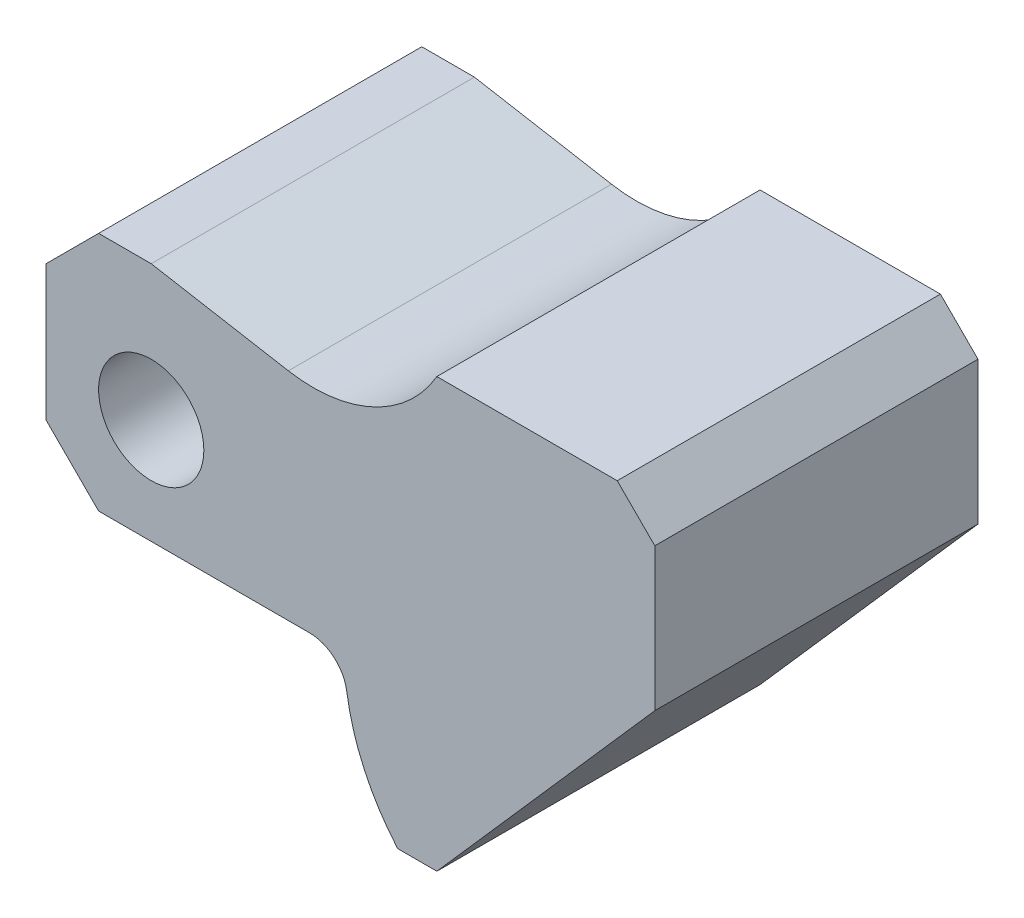
ISO-10303-21;
HEADER;
FILE_DESCRIPTION(('STEP AP214'),'2;1');
FILE_NAME('part.step','',(''),(''),'','','');
FILE_SCHEMA(('AUTOMOTIVE_DESIGN { 1 0 10303 214 1 1 1 1 }'));
ENDSEC;
DATA;
#1=APPLICATION_CONTEXT('core data for automotive mechanical design processes');
#2=APPLICATION_PROTOCOL_DEFINITION('international standard','automotive_design',2000,#1);
#3=PRODUCT_CONTEXT('',#1,'mechanical');
#4=PRODUCT('Part','Part','',(#3));
#5=PRODUCT_RELATED_PRODUCT_CATEGORY('part','',(#4));
#6=PRODUCT_DEFINITION_FORMATION('','',#4);
#7=PRODUCT_DEFINITION_CONTEXT('part definition',#1,'design');
#8=PRODUCT_DEFINITION('design','',#6,#7);
#9=PRODUCT_DEFINITION_SHAPE('','',#8);
#10=(LENGTH_UNIT() NAMED_UNIT(*) SI_UNIT(.MILLI.,.METRE.));
#11=(NAMED_UNIT(*) PLANE_ANGLE_UNIT() SI_UNIT($,.RADIAN.));
#12=(NAMED_UNIT(*) SI_UNIT($,.STERADIAN.) SOLID_ANGLE_UNIT());
#13=UNCERTAINTY_MEASURE_WITH_UNIT(LENGTH_MEASURE(1.E-05),#10,'distance_accuracy_value','');
#14=(GEOMETRIC_REPRESENTATION_CONTEXT(3) GLOBAL_UNCERTAINTY_ASSIGNED_CONTEXT((#13)) GLOBAL_UNIT_ASSIGNED_CONTEXT((#10,
#11,#12)) REPRESENTATION_CONTEXT('',''));
#15=CARTESIAN_POINT('',(0.,0.,0.));
#16=DIRECTION('',(0.,0.,1.));
#17=DIRECTION('',(1.,0.,0.));
#18=AXIS2_PLACEMENT_3D('',#15,#16,#17);
#19=CARTESIAN_POINT('',(54.6337851198582,-48.006231786545,43.));
#20=DIRECTION('',(0.751200870855045,-0.660073671362994,0.));
#21=DIRECTION('',(0.660073671362994,0.751200870855045,0.));
#22=AXIS2_PLACEMENT_3D('',#19,#20,#21);
#23=PLANE('',#22);
#24=DIRECTION('',(-0.660073671362994,-0.751200870855045,0.));
#25=VECTOR('',#24,1.);
#26=CARTESIAN_POINT('',(54.6337851198582,-48.006231786545,0.));
#27=LINE('',#26,#25);
#28=CARTESIAN_POINT('',(81.,-18.,0.));
#29=VERTEX_POINT('',#28);
#30=CARTESIAN_POINT('',(52.0031870301412,-51.,0.));
#31=VERTEX_POINT('',#30);
#32=EDGE_CURVE('E175',#29,#31,#27,.T.);
#33=ORIENTED_EDGE('',*,*,#32,.F.);
#34=DIRECTION('',(0.,0.,-1.));
#35=VECTOR('',#34,1.);
#36=CARTESIAN_POINT('',(81.,-18.,43.));
#37=LINE('',#36,#35);
#38=CARTESIAN_POINT('',(81.,-18.,43.));
#39=VERTEX_POINT('',#38);
#40=EDGE_CURVE('E161',#39,#29,#37,.T.);
#41=ORIENTED_EDGE('',*,*,#40,.F.);
#42=DIRECTION('',(-0.660073671362994,-0.751200870855045,0.));
#43=VECTOR('',#42,1.);
#44=CARTESIAN_POINT('',(54.6337851198582,-48.006231786545,43.));
#45=LINE('',#44,#43);
#46=CARTESIAN_POINT('',(52.0031870301412,-51.,43.));
#47=VERTEX_POINT('',#46);
#48=EDGE_CURVE('E170',#39,#47,#45,.T.);
#49=ORIENTED_EDGE('',*,*,#48,.T.);
#50=DIRECTION('',(0.,0.,-1.));
#51=VECTOR('',#50,1.);
#52=CARTESIAN_POINT('',(52.0031870301412,-51.,43.));
#53=LINE('',#52,#51);
#54=EDGE_CURVE('E218',#47,#31,#53,.T.);
#55=ORIENTED_EDGE('',*,*,#54,.T.);
#56=EDGE_LOOP('',(#33,#41,#49,#55));
#57=FACE_BOUND('',#56,.T.);
#58=ADVANCED_FACE('F55',(#57),#23,.T.);
#59=CARTESIAN_POINT('',(81.,0.,43.));
#60=DIRECTION('',(1.,0.,0.));
#61=DIRECTION('',(0.,1.,0.));
#62=AXIS2_PLACEMENT_3D('',#59,#60,#61);
#63=PLANE('',#62);
#64=DIRECTION('',(0.,-1.,0.));
#65=VECTOR('',#64,1.);
#66=CARTESIAN_POINT('',(81.,0.,0.));
#67=LINE('',#66,#65);
#68=CARTESIAN_POINT('',(81.,0.999999999999964,0.));
#69=VERTEX_POINT('',#68);
#70=EDGE_CURVE('E225',#69,#29,#67,.T.);
#71=ORIENTED_EDGE('',*,*,#70,.F.);
#72=DIRECTION('',(0.,0.,1.));
#73=VECTOR('',#72,1.);
#74=CARTESIAN_POINT('',(81.,0.999999999999964,43.));
#75=LINE('',#74,#73);
#76=CARTESIAN_POINT('',(81.,0.999999999999964,43.));
#77=VERTEX_POINT('',#76);
#78=EDGE_CURVE('E164',#69,#77,#75,.T.);
#79=ORIENTED_EDGE('',*,*,#78,.T.);
#80=DIRECTION('',(0.,-1.,0.));
#81=VECTOR('',#80,1.);
#82=CARTESIAN_POINT('',(81.,0.,43.));
#83=LINE('',#82,#81);
#84=EDGE_CURVE('E157',#77,#39,#83,.T.);
#85=ORIENTED_EDGE('',*,*,#84,.T.);
#86=ORIENTED_EDGE('',*,*,#40,.T.);
#87=EDGE_LOOP('',(#71,#79,#85,#86));
#88=FACE_BOUND('',#87,.T.);
#89=ADVANCED_FACE('F160',(#88),#63,.T.);
#90=CARTESIAN_POINT('',(0.,6.,43.));
#91=DIRECTION('',(0.,1.,0.));
#92=DIRECTION('',(-1.,0.,0.));
#93=AXIS2_PLACEMENT_3D('',#90,#91,#92);
#94=PLANE('',#93);
#95=DIRECTION('',(1.,0.,0.));
#96=VECTOR('',#95,1.);
#97=CARTESIAN_POINT('',(0.,6.,43.));
#98=LINE('',#97,#96);
#99=CARTESIAN_POINT('',(52.,6.,43.));
#100=VERTEX_POINT('',#99);
#101=CARTESIAN_POINT('',(76.,6.,43.));
#102=VERTEX_POINT('',#101);
#103=EDGE_CURVE('E169',#100,#102,#98,.T.);
#104=ORIENTED_EDGE('',*,*,#103,.T.);
#105=DIRECTION('',(0.,0.,-1.));
#106=VECTOR('',#105,1.);
#107=CARTESIAN_POINT('',(76.,6.,43.));
#108=LINE('',#107,#106);
#109=CARTESIAN_POINT('',(76.,6.,0.));
#110=VERTEX_POINT('',#109);
#111=EDGE_CURVE('E296',#102,#110,#108,.T.);
#112=ORIENTED_EDGE('',*,*,#111,.T.);
#113=DIRECTION('',(1.,0.,0.));
#114=VECTOR('',#113,1.);
#115=CARTESIAN_POINT('',(0.,6.,0.));
#116=LINE('',#115,#114);
#117=CARTESIAN_POINT('',(52.,6.,0.));
#118=VERTEX_POINT('',#117);
#119=EDGE_CURVE('E228',#118,#110,#116,.T.);
#120=ORIENTED_EDGE('',*,*,#119,.F.);
#121=DIRECTION('',(0.,0.,-1.));
#122=VECTOR('',#121,1.);
#123=CARTESIAN_POINT('',(52.,6.,43.));
#124=LINE('',#123,#122);
#125=EDGE_CURVE('E178',#100,#118,#124,.T.);
#126=ORIENTED_EDGE('',*,*,#125,.F.);
#127=EDGE_LOOP('',(#104,#112,#120,#126));
#128=FACE_BOUND('',#127,.T.);
#129=ADVANCED_FACE('F343',(#128),#94,.T.);
#130=CARTESIAN_POINT('',(35.5424003635473,15.4945992125119,43.));
#131=DIRECTION('',(0.,0.,-1.));
#132=DIRECTION('',(-1.,0.,0.));
#133=AXIS2_PLACEMENT_3D('',#130,#131,#132);
#134=CYLINDRICAL_SURFACE('',#133,19.);
#135=CARTESIAN_POINT('',(35.5424003635473,15.4945992125119,0.));
#136=DIRECTION('',(0.,0.,1.));
#137=DIRECTION('',(1.,0.,0.));
#138=AXIS2_PLACEMENT_3D('',#135,#136,#137);
#139=CIRCLE('',#138,19.);
#140=CARTESIAN_POINT('',(32.2430849878756,-3.21674809472005,0.));
#141=VERTEX_POINT('',#140);
#142=EDGE_CURVE('E232',#141,#118,#139,.T.);
#143=ORIENTED_EDGE('',*,*,#142,.F.);
#144=DIRECTION('',(0.,0.,-1.));
#145=VECTOR('',#144,1.);
#146=CARTESIAN_POINT('',(32.2430849878756,-3.21674809472005,43.));
#147=LINE('',#146,#145);
#148=CARTESIAN_POINT('',(32.2430849878756,-3.21674809472005,43.));
#149=VERTEX_POINT('',#148);
#150=EDGE_CURVE('E266',#149,#141,#147,.T.);
#151=ORIENTED_EDGE('',*,*,#150,.F.);
#152=CARTESIAN_POINT('',(35.5424003635473,15.4945992125119,43.));
#153=DIRECTION('',(0.,0.,1.));
#154=DIRECTION('',(1.,0.,0.));
#155=AXIS2_PLACEMENT_3D('',#152,#153,#154);
#156=CIRCLE('',#155,19.);
#157=EDGE_CURVE('E195',#149,#100,#156,.T.);
#158=ORIENTED_EDGE('',*,*,#157,.T.);
#159=ORIENTED_EDGE('',*,*,#125,.T.);
#160=EDGE_LOOP('',(#143,#151,#158,#159));
#161=FACE_BOUND('',#160,.T.);
#162=ADVANCED_FACE('F376',(#161),#134,.F.);
#163=CARTESIAN_POINT('',(0.422151654498645,2.39414100327969,43.));
#164=DIRECTION('',(0.173648177666931,0.984807753012208,0.));
#165=DIRECTION('',(-0.984807753012208,0.173648177666931,0.));
#166=AXIS2_PLACEMENT_3D('',#163,#164,#165);
#167=PLANE('',#166);
#168=DIRECTION('',(0.984807753012208,-0.173648177666931,0.));
#169=VECTOR('',#168,1.);
#170=CARTESIAN_POINT('',(0.422151654498645,2.39414100327969,0.));
#171=LINE('',#170,#169);
#172=CARTESIAN_POINT('',(14.,0.,0.));
#173=VERTEX_POINT('',#172);
#174=EDGE_CURVE('E236',#173,#141,#171,.T.);
#175=ORIENTED_EDGE('',*,*,#174,.F.);
#176=DIRECTION('',(0.,0.,-1.));
#177=VECTOR('',#176,1.);
#178=CARTESIAN_POINT('',(14.,0.,43.));
#179=LINE('',#178,#177);
#180=CARTESIAN_POINT('',(14.,0.,43.));
#181=VERTEX_POINT('',#180);
#182=EDGE_CURVE('E262',#181,#173,#179,.T.);
#183=ORIENTED_EDGE('',*,*,#182,.F.);
#184=DIRECTION('',(0.984807753012208,-0.173648177666931,0.));
#185=VECTOR('',#184,1.);
#186=CARTESIAN_POINT('',(0.422151654498645,2.39414100327969,43.));
#187=LINE('',#186,#185);
#188=EDGE_CURVE('E199',#181,#149,#187,.T.);
#189=ORIENTED_EDGE('',*,*,#188,.T.);
#190=ORIENTED_EDGE('',*,*,#150,.T.);
#191=EDGE_LOOP('',(#175,#183,#189,#190));
#192=FACE_BOUND('',#191,.T.);
#193=ADVANCED_FACE('F382',(#192),#167,.T.);
#194=CARTESIAN_POINT('',(0.,0.,43.));
#195=DIRECTION('',(0.,1.,0.));
#196=DIRECTION('',(0.,0.,1.));
#197=AXIS2_PLACEMENT_3D('',#194,#195,#196);
#198=PLANE('',#197);
#199=DIRECTION('',(1.,0.,0.));
#200=VECTOR('',#199,1.);
#201=CARTESIAN_POINT('',(0.,0.,0.));
#202=LINE('',#201,#200);
#203=CARTESIAN_POINT('',(7.00000000000003,0.,0.));
#204=VERTEX_POINT('',#203);
#205=EDGE_CURVE('E240',#204,#173,#202,.T.);
#206=ORIENTED_EDGE('',*,*,#205,.F.);
#207=DIRECTION('',(0.,0.,1.));
#208=VECTOR('',#207,1.);
#209=CARTESIAN_POINT('',(7.00000000000003,0.,43.));
#210=LINE('',#209,#208);
#211=CARTESIAN_POINT('',(7.00000000000003,0.,43.));
#212=VERTEX_POINT('',#211);
#213=EDGE_CURVE('E277',#204,#212,#210,.T.);
#214=ORIENTED_EDGE('',*,*,#213,.T.);
#215=DIRECTION('',(1.,0.,0.));
#216=VECTOR('',#215,1.);
#217=CARTESIAN_POINT('',(0.,0.,43.));
#218=LINE('',#217,#216);
#219=EDGE_CURVE('E203',#212,#181,#218,.T.);
#220=ORIENTED_EDGE('',*,*,#219,.T.);
#221=ORIENTED_EDGE('',*,*,#182,.T.);
#222=EDGE_LOOP('',(#206,#214,#220,#221));
#223=FACE_BOUND('',#222,.T.);
#224=ADVANCED_FACE('F385',(#223),#198,.T.);
#225=CARTESIAN_POINT('',(0.,0.,43.));
#226=DIRECTION('',(1.,0.,0.));
#227=DIRECTION('',(0.,0.,-1.));
#228=AXIS2_PLACEMENT_3D('',#225,#226,#227);
#229=PLANE('',#228);
#230=DIRECTION('',(0.,-1.,0.));
#231=VECTOR('',#230,1.);
#232=CARTESIAN_POINT('',(0.,0.,0.));
#233=LINE('',#232,#231);
#234=CARTESIAN_POINT('',(0.,-7.00000000000001,0.));
#235=VERTEX_POINT('',#234);
#236=CARTESIAN_POINT('',(0.,-25.,0.));
#237=VERTEX_POINT('',#236);
#238=EDGE_CURVE('E243',#235,#237,#233,.T.);
#239=ORIENTED_EDGE('',*,*,#238,.T.);
#240=DIRECTION('',(0.,0.,1.));
#241=VECTOR('',#240,1.);
#242=CARTESIAN_POINT('',(0.,-25.,43.));
#243=LINE('',#242,#241);
#244=CARTESIAN_POINT('',(0.,-25.,43.));
#245=VERTEX_POINT('',#244);
#246=EDGE_CURVE('E290',#237,#245,#243,.T.);
#247=ORIENTED_EDGE('',*,*,#246,.T.);
#248=DIRECTION('',(0.,-1.,0.));
#249=VECTOR('',#248,1.);
#250=CARTESIAN_POINT('',(0.,0.,43.));
#251=LINE('',#250,#249);
#252=CARTESIAN_POINT('',(0.,-7.00000000000001,43.));
#253=VERTEX_POINT('',#252);
#254=EDGE_CURVE('E206',#253,#245,#251,.T.);
#255=ORIENTED_EDGE('',*,*,#254,.F.);
#256=DIRECTION('',(0.,0.,-1.));
#257=VECTOR('',#256,1.);
#258=CARTESIAN_POINT('',(0.,-7.00000000000001,0.));
#259=LINE('',#258,#257);
#260=EDGE_CURVE('E177',#253,#235,#259,.T.);
#261=ORIENTED_EDGE('',*,*,#260,.T.);
#262=EDGE_LOOP('',(#239,#247,#255,#261));
#263=FACE_BOUND('',#262,.T.);
#264=ADVANCED_FACE('F392',(#263),#229,.F.);
#265=CARTESIAN_POINT('',(0.,-32.,43.));
#266=DIRECTION('',(0.,1.,0.));
#267=DIRECTION('',(-1.,0.,0.));
#268=AXIS2_PLACEMENT_3D('',#265,#266,#267);
#269=PLANE('',#268);
#270=DIRECTION('',(1.,0.,0.));
#271=VECTOR('',#270,1.);
#272=CARTESIAN_POINT('',(0.,-32.,0.));
#273=LINE('',#272,#271);
#274=CARTESIAN_POINT('',(7.00000000000001,-32.,0.));
#275=VERTEX_POINT('',#274);
#276=CARTESIAN_POINT('',(35.0679778916118,-32.,0.));
#277=VERTEX_POINT('',#276);
#278=EDGE_CURVE('E247',#275,#277,#273,.T.);
#279=ORIENTED_EDGE('',*,*,#278,.T.);
#280=DIRECTION('',(0.,0.,1.));
#281=VECTOR('',#280,1.);
#282=CARTESIAN_POINT('',(35.0679778916118,-32.,43.));
#283=LINE('',#282,#281);
#284=CARTESIAN_POINT('',(35.0679778916118,-32.,43.));
#285=VERTEX_POINT('',#284);
#286=EDGE_CURVE('E77',#277,#285,#283,.T.);
#287=ORIENTED_EDGE('',*,*,#286,.T.);
#288=DIRECTION('',(1.,0.,0.));
#289=VECTOR('',#288,1.);
#290=CARTESIAN_POINT('',(0.,-32.,43.));
#291=LINE('',#290,#289);
#292=CARTESIAN_POINT('',(7.00000000000001,-32.,43.));
#293=VERTEX_POINT('',#292);
#294=EDGE_CURVE('E210',#293,#285,#291,.T.);
#295=ORIENTED_EDGE('',*,*,#294,.F.);
#296=DIRECTION('',(0.,0.,-1.));
#297=VECTOR('',#296,1.);
#298=CARTESIAN_POINT('',(7.00000000000001,-32.,43.));
#299=LINE('',#298,#297);
#300=EDGE_CURVE('E283',#293,#275,#299,.T.);
#301=ORIENTED_EDGE('',*,*,#300,.T.);
#302=EDGE_LOOP('',(#279,#287,#295,#301));
#303=FACE_BOUND('',#302,.T.);
#304=ADVANCED_FACE('F396',(#303),#269,.F.);
#305=CARTESIAN_POINT('',(68.6983217703629,-32.,43.));
#306=DIRECTION('',(0.,0.,-1.));
#307=DIRECTION('',(-1.,0.,0.));
#308=AXIS2_PLACEMENT_3D('',#305,#306,#307);
#309=CYLINDRICAL_SURFACE('',#308,29.0000004323979);
#310=CARTESIAN_POINT('',(68.6983217703629,-32.,43.));
#311=DIRECTION('',(0.,0.,1.));
#312=DIRECTION('',(1.,0.,0.));
#313=AXIS2_PLACEMENT_3D('',#310,#311,#312);
#314=CIRCLE('',#313,29.0000004323979);
#315=CARTESIAN_POINT('',(40.0136166344139,-36.2647058917041,43.));
#316=VERTEX_POINT('',#315);
#317=CARTESIAN_POINT('',(46.7894188978073,-51.,43.));
#318=VERTEX_POINT('',#317);
#319=EDGE_CURVE('E213',#316,#318,#314,.T.);
#320=ORIENTED_EDGE('',*,*,#319,.F.);
#321=DIRECTION('',(0.,0.,-1.));
#322=VECTOR('',#321,1.);
#323=CARTESIAN_POINT('',(40.0136166344139,-36.2647058917041,43.));
#324=LINE('',#323,#322);
#325=CARTESIAN_POINT('',(40.0136166344139,-36.2647058917041,0.));
#326=VERTEX_POINT('',#325);
#327=EDGE_CURVE('E308',#316,#326,#324,.T.);
#328=ORIENTED_EDGE('',*,*,#327,.T.);
#329=CARTESIAN_POINT('',(68.6983217703629,-32.,0.));
#330=DIRECTION('',(0.,0.,1.));
#331=DIRECTION('',(1.,0.,0.));
#332=AXIS2_PLACEMENT_3D('',#329,#330,#331);
#333=CIRCLE('',#332,29.0000004323979);
#334=CARTESIAN_POINT('',(46.7894188978073,-51.,0.));
#335=VERTEX_POINT('',#334);
#336=EDGE_CURVE('E250',#326,#335,#333,.T.);
#337=ORIENTED_EDGE('',*,*,#336,.T.);
#338=DIRECTION('',(0.,0.,-1.));
#339=VECTOR('',#338,1.);
#340=CARTESIAN_POINT('',(46.7894188978073,-51.,43.));
#341=LINE('',#340,#339);
#342=EDGE_CURVE('E258',#318,#335,#341,.T.);
#343=ORIENTED_EDGE('',*,*,#342,.F.);
#344=EDGE_LOOP('',(#320,#328,#337,#343));
#345=FACE_BOUND('',#344,.T.);
#346=ADVANCED_FACE('F317',(#345),#309,.T.);
#347=CARTESIAN_POINT('',(14.,-18.,43.));
#348=DIRECTION('',(0.,0.,-1.));
#349=DIRECTION('',(-1.,0.,0.));
#350=AXIS2_PLACEMENT_3D('',#347,#348,#349);
#351=CYLINDRICAL_SURFACE('',#350,7.);
#352=CARTESIAN_POINT('',(14.,-18.,43.));
#353=DIRECTION('',(0.,0.,1.));
#354=DIRECTION('',(1.,0.,0.));
#355=AXIS2_PLACEMENT_3D('',#352,#353,#354);
#356=CIRCLE('',#355,7.);
#357=CARTESIAN_POINT('',(21.,-18.,43.));
#358=VERTEX_POINT('',#357);
#359=EDGE_CURVE('E185',#358,#358,#356,.T.);
#360=ORIENTED_EDGE('',*,*,#359,.T.);
#361=EDGE_LOOP('',(#360));
#362=FACE_BOUND('',#361,.T.);
#363=CARTESIAN_POINT('',(14.,-18.,0.));
#364=DIRECTION('',(0.,0.,1.));
#365=DIRECTION('',(1.,0.,0.));
#366=AXIS2_PLACEMENT_3D('',#363,#364,#365);
#367=CIRCLE('',#366,7.);
#368=CARTESIAN_POINT('',(21.,-18.,0.));
#369=VERTEX_POINT('',#368);
#370=EDGE_CURVE('E219',#369,#369,#367,.T.);
#371=ORIENTED_EDGE('',*,*,#370,.F.);
#372=EDGE_LOOP('',(#371));
#373=FACE_BOUND('',#372,.T.);
#374=ADVANCED_FACE('F326',(#362,#373),#351,.F.);
#375=CARTESIAN_POINT('',(0.,-51.0000000000001,43.));
#376=DIRECTION('',(0.,1.,0.));
#377=DIRECTION('',(-1.,0.,0.));
#378=AXIS2_PLACEMENT_3D('',#375,#376,#377);
#379=PLANE('',#378);
#380=DIRECTION('',(1.,0.,0.));
#381=VECTOR('',#380,1.);
#382=CARTESIAN_POINT('',(0.,-51.0000000000001,0.));
#383=LINE('',#382,#381);
#384=EDGE_CURVE('E189',#335,#31,#383,.T.);
#385=ORIENTED_EDGE('',*,*,#384,.T.);
#386=ORIENTED_EDGE('',*,*,#54,.F.);
#387=DIRECTION('',(1.,0.,0.));
#388=VECTOR('',#387,1.);
#389=CARTESIAN_POINT('',(0.,-51.0000000000001,43.));
#390=LINE('',#389,#388);
#391=EDGE_CURVE('E182',#318,#47,#390,.T.);
#392=ORIENTED_EDGE('',*,*,#391,.F.);
#393=ORIENTED_EDGE('',*,*,#342,.T.);
#394=EDGE_LOOP('',(#385,#386,#392,#393));
#395=FACE_BOUND('',#394,.T.);
#396=ADVANCED_FACE('F324',(#395),#379,.F.);
#397=CARTESIAN_POINT('',(0.,0.,43.));
#398=DIRECTION('',(0.,0.,1.));
#399=DIRECTION('',(1.,0.,0.));
#400=AXIS2_PLACEMENT_3D('',#397,#398,#399);
#401=PLANE('',#400);
#402=ORIENTED_EDGE('',*,*,#359,.F.);
#403=EDGE_LOOP('',(#402));
#404=FACE_BOUND('',#403,.T.);
#405=ORIENTED_EDGE('',*,*,#84,.F.);
#406=DIRECTION('',(0.707106781186547,-0.707106781186549,0.));
#407=VECTOR('',#406,1.);
#408=CARTESIAN_POINT('',(41.0000000000001,41.,43.));
#409=LINE('',#408,#407);
#410=EDGE_CURVE('E305',#77,#102,#409,.F.);
#411=ORIENTED_EDGE('',*,*,#410,.T.);
#412=ORIENTED_EDGE('',*,*,#103,.F.);
#413=ORIENTED_EDGE('',*,*,#157,.F.);
#414=ORIENTED_EDGE('',*,*,#188,.F.);
#415=ORIENTED_EDGE('',*,*,#219,.F.);
#416=DIRECTION('',(-0.707106781186549,-0.707106781186546,0.));
#417=VECTOR('',#416,1.);
#418=CARTESIAN_POINT('',(3.5,-3.50000000000002,43.));
#419=LINE('',#418,#417);
#420=EDGE_CURVE('E280',#212,#253,#419,.T.);
#421=ORIENTED_EDGE('',*,*,#420,.T.);
#422=ORIENTED_EDGE('',*,*,#254,.T.);
#423=DIRECTION('',(-0.707106781186546,0.707106781186549,0.));
#424=VECTOR('',#423,1.);
#425=CARTESIAN_POINT('',(-12.5,-12.4999999999999,43.));
#426=LINE('',#425,#424);
#427=EDGE_CURVE('E293',#245,#293,#426,.F.);
#428=ORIENTED_EDGE('',*,*,#427,.T.);
#429=ORIENTED_EDGE('',*,*,#294,.T.);
#430=CARTESIAN_POINT('',(35.0679778916118,-37.,43.));
#431=DIRECTION('',(0.,0.,1.));
#432=DIRECTION('',(1.,0.,0.));
#433=AXIS2_PLACEMENT_3D('',#430,#431,#432);
#434=CIRCLE('',#433,5.);
#435=EDGE_CURVE('E11',#285,#316,#434,.F.);
#436=ORIENTED_EDGE('',*,*,#435,.T.);
#437=ORIENTED_EDGE('',*,*,#319,.T.);
#438=ORIENTED_EDGE('',*,*,#391,.T.);
#439=ORIENTED_EDGE('',*,*,#48,.F.);
#440=EDGE_LOOP('',(#405,#411,#412,#413,#414,#415,#421,#422,#428,#429,#436,#437,#438,#439));
#441=FACE_BOUND('',#440,.T.);
#442=ADVANCED_FACE('F180',(#404,#441),#401,.T.);
#443=CARTESIAN_POINT('',(0.,0.,0.));
#444=DIRECTION('',(0.,0.,1.));
#445=DIRECTION('',(1.,0.,0.));
#446=AXIS2_PLACEMENT_3D('',#443,#444,#445);
#447=PLANE('',#446);
#448=ORIENTED_EDGE('',*,*,#370,.T.);
#449=EDGE_LOOP('',(#448));
#450=FACE_BOUND('',#449,.T.);
#451=ORIENTED_EDGE('',*,*,#119,.T.);
#452=DIRECTION('',(-0.707106781186547,0.707106781186549,0.));
#453=VECTOR('',#452,1.);
#454=CARTESIAN_POINT('',(76.,6.,0.));
#455=LINE('',#454,#453);
#456=EDGE_CURVE('E300',#110,#69,#455,.F.);
#457=ORIENTED_EDGE('',*,*,#456,.T.);
#458=ORIENTED_EDGE('',*,*,#70,.T.);
#459=ORIENTED_EDGE('',*,*,#32,.T.);
#460=ORIENTED_EDGE('',*,*,#384,.F.);
#461=ORIENTED_EDGE('',*,*,#336,.F.);
#462=CARTESIAN_POINT('',(35.0679778916118,-37.,0.));
#463=DIRECTION('',(0.,0.,1.));
#464=DIRECTION('',(1.,0.,0.));
#465=AXIS2_PLACEMENT_3D('',#462,#463,#464);
#466=CIRCLE('',#465,5.);
#467=EDGE_CURVE('E64',#326,#277,#466,.T.);
#468=ORIENTED_EDGE('',*,*,#467,.T.);
#469=ORIENTED_EDGE('',*,*,#278,.F.);
#470=DIRECTION('',(0.707106781186546,-0.707106781186549,0.));
#471=VECTOR('',#470,1.);
#472=CARTESIAN_POINT('',(7.00000000000001,-32.,0.));
#473=LINE('',#472,#471);
#474=EDGE_CURVE('E287',#275,#237,#473,.F.);
#475=ORIENTED_EDGE('',*,*,#474,.T.);
#476=ORIENTED_EDGE('',*,*,#238,.F.);
#477=DIRECTION('',(0.707106781186549,0.707106781186546,0.));
#478=VECTOR('',#477,1.);
#479=CARTESIAN_POINT('',(0.,-7.00000000000001,0.));
#480=LINE('',#479,#478);
#481=EDGE_CURVE('E274',#235,#204,#480,.T.);
#482=ORIENTED_EDGE('',*,*,#481,.T.);
#483=ORIENTED_EDGE('',*,*,#205,.T.);
#484=ORIENTED_EDGE('',*,*,#174,.T.);
#485=ORIENTED_EDGE('',*,*,#142,.T.);
#486=EDGE_LOOP('',(#451,#457,#458,#459,#460,#461,#468,#469,#475,#476,#482,#483,#484,#485));
#487=FACE_BOUND('',#486,.T.);
#488=ADVANCED_FACE('F322',(#450,#487),#447,.F.);
#489=CARTESIAN_POINT('',(0.,-7.00000000000001,43.));
#490=DIRECTION('',(-0.707106781186546,0.707106781186549,0.));
#491=DIRECTION('',(0.,0.,1.));
#492=AXIS2_PLACEMENT_3D('',#489,#490,#491);
#493=PLANE('',#492);
#494=ORIENTED_EDGE('',*,*,#420,.F.);
#495=ORIENTED_EDGE('',*,*,#213,.F.);
#496=ORIENTED_EDGE('',*,*,#481,.F.);
#497=ORIENTED_EDGE('',*,*,#260,.F.);
#498=EDGE_LOOP('',(#494,#495,#496,#497));
#499=FACE_BOUND('',#498,.T.);
#500=ADVANCED_FACE('F348',(#499),#493,.T.);
#501=CARTESIAN_POINT('',(7.00000000000001,-32.,43.));
#502=DIRECTION('',(0.707106781186549,0.707106781186546,0.));
#503=DIRECTION('',(0.,0.,-1.));
#504=AXIS2_PLACEMENT_3D('',#501,#502,#503);
#505=PLANE('',#504);
#506=ORIENTED_EDGE('',*,*,#427,.F.);
#507=ORIENTED_EDGE('',*,*,#246,.F.);
#508=ORIENTED_EDGE('',*,*,#474,.F.);
#509=ORIENTED_EDGE('',*,*,#300,.F.);
#510=EDGE_LOOP('',(#506,#507,#508,#509));
#511=FACE_BOUND('',#510,.T.);
#512=ADVANCED_FACE('F354',(#511),#505,.F.);
#513=CARTESIAN_POINT('',(76.,6.,43.));
#514=DIRECTION('',(-0.707106781186548,-0.707106781186546,0.));
#515=DIRECTION('',(0.,0.,-1.));
#516=AXIS2_PLACEMENT_3D('',#513,#514,#515);
#517=PLANE('',#516);
#518=ORIENTED_EDGE('',*,*,#410,.F.);
#519=ORIENTED_EDGE('',*,*,#78,.F.);
#520=ORIENTED_EDGE('',*,*,#456,.F.);
#521=ORIENTED_EDGE('',*,*,#111,.F.);
#522=EDGE_LOOP('',(#518,#519,#520,#521));
#523=FACE_BOUND('',#522,.T.);
#524=ADVANCED_FACE('F360',(#523),#517,.F.);
#525=CARTESIAN_POINT('',(35.0679778916118,-37.,43.));
#526=DIRECTION('',(0.,0.,-1.));
#527=DIRECTION('',(-1.,0.,0.));
#528=AXIS2_PLACEMENT_3D('',#525,#526,#527);
#529=CYLINDRICAL_SURFACE('',#528,5.);
#530=ORIENTED_EDGE('',*,*,#435,.F.);
#531=ORIENTED_EDGE('',*,*,#286,.F.);
#532=ORIENTED_EDGE('',*,*,#467,.F.);
#533=ORIENTED_EDGE('',*,*,#327,.F.);
#534=EDGE_LOOP('',(#530,#531,#532,#533));
#535=FACE_BOUND('',#534,.T.);
#536=ADVANCED_FACE('F57',(#535),#529,.F.);
#537=CLOSED_SHELL('',(#58,#89,#129,#162,#193,#224,#264,#304,#346,#374,#396,#442,#488,#500,#512,
#524,#536));
#538=MANIFOLD_SOLID_BREP('B2',#537);
#539=ADVANCED_BREP_SHAPE_REPRESENTATION('',(#18,#538),#14);
#540=SHAPE_DEFINITION_REPRESENTATION(#9,#539);
ENDSEC;
END-ISO-10303-21;
